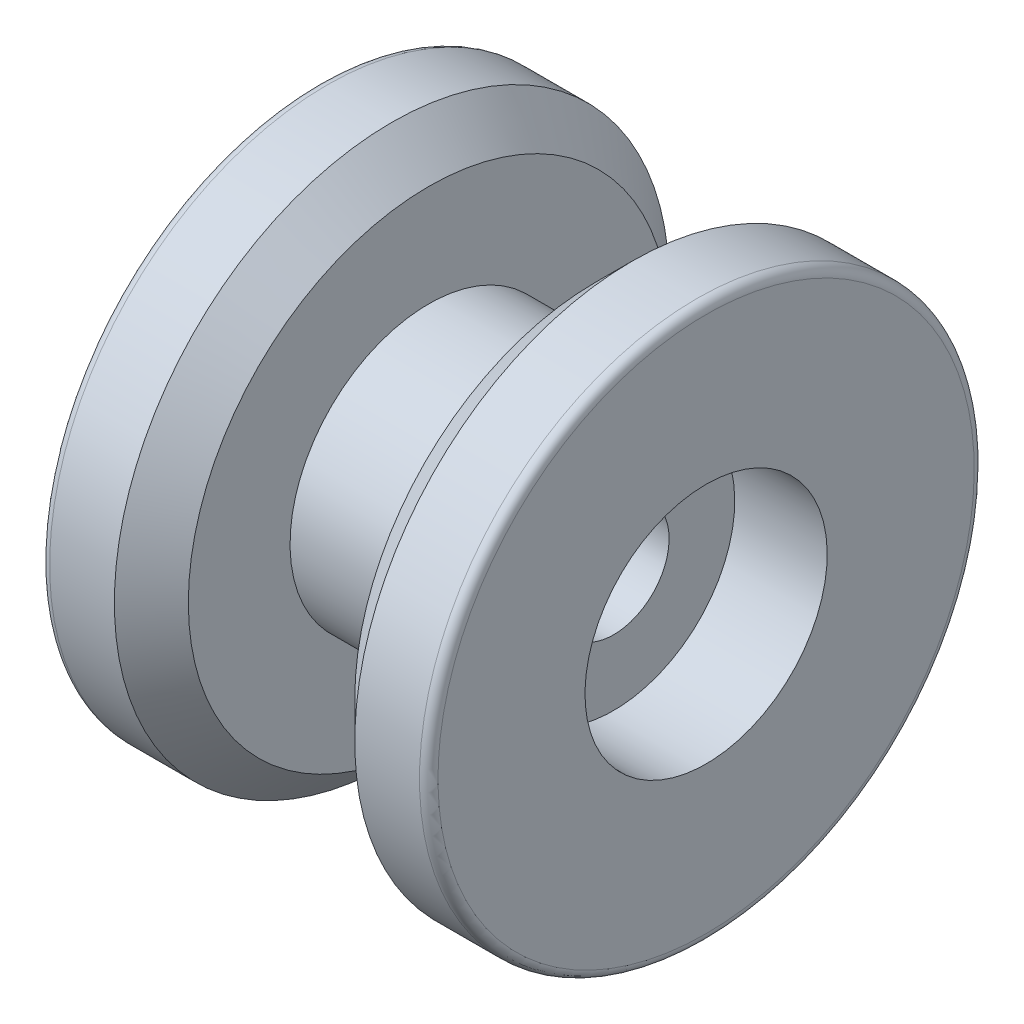
ISO-10303-21;
HEADER;
FILE_DESCRIPTION(('STEP AP214'),'2;1');
FILE_NAME('part.step','',(''),(''),'','','');
FILE_SCHEMA(('AUTOMOTIVE_DESIGN { 1 0 10303 214 1 1 1 1 }'));
ENDSEC;
DATA;
#1=APPLICATION_CONTEXT('core data for automotive mechanical design processes');
#2=APPLICATION_PROTOCOL_DEFINITION('international standard','automotive_design',2000,#1);
#3=PRODUCT_CONTEXT('',#1,'mechanical');
#4=PRODUCT('Part','Part','',(#3));
#5=PRODUCT_RELATED_PRODUCT_CATEGORY('part','',(#4));
#6=PRODUCT_DEFINITION_FORMATION('','',#4);
#7=PRODUCT_DEFINITION_CONTEXT('part definition',#1,'design');
#8=PRODUCT_DEFINITION('design','',#6,#7);
#9=PRODUCT_DEFINITION_SHAPE('','',#8);
#10=(LENGTH_UNIT() NAMED_UNIT(*) SI_UNIT(.MILLI.,.METRE.));
#11=(NAMED_UNIT(*) PLANE_ANGLE_UNIT() SI_UNIT($,.RADIAN.));
#12=(NAMED_UNIT(*) SI_UNIT($,.STERADIAN.) SOLID_ANGLE_UNIT());
#13=UNCERTAINTY_MEASURE_WITH_UNIT(LENGTH_MEASURE(1.E-05),#10,'distance_accuracy_value','');
#14=(GEOMETRIC_REPRESENTATION_CONTEXT(3) GLOBAL_UNCERTAINTY_ASSIGNED_CONTEXT((#13)) GLOBAL_UNIT_ASSIGNED_CONTEXT((#10,
#11,#12)) REPRESENTATION_CONTEXT('',''));
#15=CARTESIAN_POINT('',(0.,0.,0.));
#16=DIRECTION('',(0.,0.,1.));
#17=DIRECTION('',(1.,0.,0.));
#18=AXIS2_PLACEMENT_3D('',#15,#16,#17);
#19=CARTESIAN_POINT('',(-21.,0.,0.));
#20=DIRECTION('',(1.,0.,0.));
#21=DIRECTION('',(0.,1.,0.));
#22=AXIS2_PLACEMENT_3D('',#19,#20,#21);
#23=CYLINDRICAL_SURFACE('',#22,6.);
#24=CARTESIAN_POINT('',(-21.,0.,0.));
#25=DIRECTION('',(-1.,0.,0.));
#26=DIRECTION('',(0.,1.,0.));
#27=AXIS2_PLACEMENT_3D('',#24,#25,#26);
#28=CIRCLE('',#27,6.);
#29=CARTESIAN_POINT('',(-21.,6.,0.));
#30=VERTEX_POINT('',#29);
#31=EDGE_CURVE('E73',#30,#30,#28,.T.);
#32=ORIENTED_EDGE('',*,*,#31,.T.);
#33=EDGE_LOOP('',(#32));
#34=FACE_BOUND('',#33,.T.);
#35=CARTESIAN_POINT('',(11.,0.,0.));
#36=DIRECTION('',(-1.,0.,0.));
#37=DIRECTION('',(0.,1.,0.));
#38=AXIS2_PLACEMENT_3D('',#35,#36,#37);
#39=CIRCLE('',#38,6.);
#40=CARTESIAN_POINT('',(11.,6.,0.));
#41=VERTEX_POINT('',#40);
#42=EDGE_CURVE('E39',#41,#41,#39,.F.);
#43=ORIENTED_EDGE('',*,*,#42,.T.);
#44=EDGE_LOOP('',(#43));
#45=FACE_BOUND('',#44,.T.);
#46=ADVANCED_FACE('F35',(#34,#45),#23,.F.);
#47=CARTESIAN_POINT('',(-21.,30.,0.));
#48=DIRECTION('',(1.,0.,0.));
#49=DIRECTION('',(0.,1.,0.));
#50=AXIS2_PLACEMENT_3D('',#47,#48,#49);
#51=PLANE('',#50);
#52=CARTESIAN_POINT('',(-21.,0.,0.));
#53=DIRECTION('',(-1.,0.,0.));
#54=DIRECTION('',(0.,1.,0.));
#55=AXIS2_PLACEMENT_3D('',#52,#53,#54);
#56=CIRCLE('',#55,29.);
#57=CARTESIAN_POINT('',(-21.,29.,0.));
#58=VERTEX_POINT('',#57);
#59=EDGE_CURVE('E43',#58,#58,#56,.F.);
#60=ORIENTED_EDGE('',*,*,#59,.F.);
#61=EDGE_LOOP('',(#60));
#62=FACE_BOUND('',#61,.T.);
#63=ORIENTED_EDGE('',*,*,#31,.F.);
#64=EDGE_LOOP('',(#63));
#65=FACE_BOUND('',#64,.T.);
#66=ADVANCED_FACE('F99',(#62,#65),#51,.F.);
#67=CARTESIAN_POINT('',(21.,0.,0.));
#68=DIRECTION('',(-1.,0.,0.));
#69=DIRECTION('',(0.,-1.,0.));
#70=AXIS2_PLACEMENT_3D('',#67,#68,#69);
#71=PLANE('',#70);
#72=CARTESIAN_POINT('',(21.,0.,0.));
#73=DIRECTION('',(-1.,0.,0.));
#74=DIRECTION('',(0.,1.,0.));
#75=AXIS2_PLACEMENT_3D('',#72,#73,#74);
#76=CIRCLE('',#75,13.1);
#77=CARTESIAN_POINT('',(21.,13.1,0.));
#78=VERTEX_POINT('',#77);
#79=EDGE_CURVE('E76',#78,#78,#76,.T.);
#80=ORIENTED_EDGE('',*,*,#79,.T.);
#81=EDGE_LOOP('',(#80));
#82=FACE_BOUND('',#81,.T.);
#83=CARTESIAN_POINT('',(21.,0.,0.));
#84=DIRECTION('',(1.,0.,0.));
#85=DIRECTION('',(0.,-1.,0.));
#86=AXIS2_PLACEMENT_3D('',#83,#84,#85);
#87=CIRCLE('',#86,29.);
#88=CARTESIAN_POINT('',(21.,-29.,0.));
#89=VERTEX_POINT('',#88);
#90=EDGE_CURVE('E47',#89,#89,#87,.F.);
#91=ORIENTED_EDGE('',*,*,#90,.F.);
#92=EDGE_LOOP('',(#91));
#93=FACE_BOUND('',#92,.T.);
#94=ADVANCED_FACE('F105',(#82,#93),#71,.F.);
#95=CARTESIAN_POINT('',(-21.,0.,0.));
#96=DIRECTION('',(-1.,0.,0.));
#97=DIRECTION('',(0.,-1.,0.));
#98=AXIS2_PLACEMENT_3D('',#95,#96,#97);
#99=CYLINDRICAL_SURFACE('',#98,30.);
#100=CARTESIAN_POINT('',(20.,0.,0.));
#101=DIRECTION('',(1.,0.,0.));
#102=DIRECTION('',(0.,-1.,0.));
#103=AXIS2_PLACEMENT_3D('',#100,#101,#102);
#104=CIRCLE('',#103,30.);
#105=CARTESIAN_POINT('',(20.,-30.,0.));
#106=VERTEX_POINT('',#105);
#107=EDGE_CURVE('E52',#106,#106,#104,.T.);
#108=ORIENTED_EDGE('',*,*,#107,.F.);
#109=EDGE_LOOP('',(#108));
#110=FACE_BOUND('',#109,.T.);
#111=CARTESIAN_POINT('',(13.,0.,0.));
#112=DIRECTION('',(-1.,0.,0.));
#113=DIRECTION('',(0.,1.,0.));
#114=AXIS2_PLACEMENT_3D('',#111,#112,#113);
#115=CIRCLE('',#114,30.);
#116=CARTESIAN_POINT('',(13.,30.,0.));
#117=VERTEX_POINT('',#116);
#118=EDGE_CURVE('E61',#117,#117,#115,.T.);
#119=ORIENTED_EDGE('',*,*,#118,.F.);
#120=EDGE_LOOP('',(#119));
#121=FACE_BOUND('',#120,.T.);
#122=ADVANCED_FACE('F125',(#110,#121),#99,.T.);
#123=CARTESIAN_POINT('',(9.,30.,0.));
#124=DIRECTION('',(1.,0.,0.));
#125=DIRECTION('',(0.,1.,0.));
#126=AXIS2_PLACEMENT_3D('',#123,#124,#125);
#127=PLANE('',#126);
#128=CARTESIAN_POINT('',(9.,0.,0.));
#129=DIRECTION('',(-1.,0.,0.));
#130=DIRECTION('',(0.,1.,0.));
#131=AXIS2_PLACEMENT_3D('',#128,#129,#130);
#132=CIRCLE('',#131,26.);
#133=CARTESIAN_POINT('',(9.,26.,0.));
#134=VERTEX_POINT('',#133);
#135=EDGE_CURVE('E64',#134,#134,#132,.F.);
#136=ORIENTED_EDGE('',*,*,#135,.F.);
#137=EDGE_LOOP('',(#136));
#138=FACE_BOUND('',#137,.T.);
#139=CARTESIAN_POINT('',(9.,0.,0.));
#140=DIRECTION('',(1.,0.,0.));
#141=DIRECTION('',(0.,-1.,0.));
#142=AXIS2_PLACEMENT_3D('',#139,#140,#141);
#143=CIRCLE('',#142,15.);
#144=CARTESIAN_POINT('',(9.00000000000001,-15.,0.));
#145=VERTEX_POINT('',#144);
#146=EDGE_CURVE('E67',#145,#145,#143,.T.);
#147=ORIENTED_EDGE('',*,*,#146,.T.);
#148=EDGE_LOOP('',(#147));
#149=FACE_BOUND('',#148,.T.);
#150=ADVANCED_FACE('F121',(#138,#149),#127,.F.);
#151=CARTESIAN_POINT('',(-21.,0.,0.));
#152=DIRECTION('',(-1.,0.,0.));
#153=DIRECTION('',(0.,-1.,0.));
#154=AXIS2_PLACEMENT_3D('',#151,#152,#153);
#155=CYLINDRICAL_SURFACE('',#154,15.);
#156=CARTESIAN_POINT('',(-9.,0.,0.));
#157=DIRECTION('',(1.,0.,0.));
#158=DIRECTION('',(0.,-1.,0.));
#159=AXIS2_PLACEMENT_3D('',#156,#157,#158);
#160=CIRCLE('',#159,15.);
#161=CARTESIAN_POINT('',(-8.99999999999999,-15.,0.));
#162=VERTEX_POINT('',#161);
#163=EDGE_CURVE('E70',#162,#162,#160,.T.);
#164=ORIENTED_EDGE('',*,*,#163,.T.);
#165=EDGE_LOOP('',(#164));
#166=FACE_BOUND('',#165,.T.);
#167=ORIENTED_EDGE('',*,*,#146,.F.);
#168=EDGE_LOOP('',(#167));
#169=FACE_BOUND('',#168,.T.);
#170=ADVANCED_FACE('F117',(#166,#169),#155,.T.);
#171=CARTESIAN_POINT('',(-9.,15.,0.));
#172=DIRECTION('',(-1.,0.,0.));
#173=DIRECTION('',(0.,-1.,0.));
#174=AXIS2_PLACEMENT_3D('',#171,#172,#173);
#175=PLANE('',#174);
#176=CARTESIAN_POINT('',(-8.99999999999999,0.,0.));
#177=DIRECTION('',(1.,0.,0.));
#178=DIRECTION('',(0.,-1.,0.));
#179=AXIS2_PLACEMENT_3D('',#176,#177,#178);
#180=CIRCLE('',#179,25.9999999999999);
#181=CARTESIAN_POINT('',(-8.99999999999999,-25.9999999999999,0.));
#182=VERTEX_POINT('',#181);
#183=EDGE_CURVE('E55',#182,#182,#180,.F.);
#184=ORIENTED_EDGE('',*,*,#183,.F.);
#185=EDGE_LOOP('',(#184));
#186=FACE_BOUND('',#185,.T.);
#187=ORIENTED_EDGE('',*,*,#163,.F.);
#188=EDGE_LOOP('',(#187));
#189=FACE_BOUND('',#188,.T.);
#190=ADVANCED_FACE('F113',(#186,#189),#175,.F.);
#191=CARTESIAN_POINT('',(-21.,0.,0.));
#192=DIRECTION('',(-1.,0.,0.));
#193=DIRECTION('',(0.,-1.,0.));
#194=AXIS2_PLACEMENT_3D('',#191,#192,#193);
#195=CYLINDRICAL_SURFACE('',#194,30.);
#196=CARTESIAN_POINT('',(-20.,0.,0.));
#197=DIRECTION('',(-1.,0.,0.));
#198=DIRECTION('',(0.,1.,0.));
#199=AXIS2_PLACEMENT_3D('',#196,#197,#198);
#200=CIRCLE('',#199,30.);
#201=CARTESIAN_POINT('',(-20.,30.,0.));
#202=VERTEX_POINT('',#201);
#203=EDGE_CURVE('E10',#202,#202,#200,.T.);
#204=ORIENTED_EDGE('',*,*,#203,.F.);
#205=EDGE_LOOP('',(#204));
#206=FACE_BOUND('',#205,.T.);
#207=CARTESIAN_POINT('',(-13.,0.,0.));
#208=DIRECTION('',(1.,0.,0.));
#209=DIRECTION('',(0.,-1.,0.));
#210=AXIS2_PLACEMENT_3D('',#207,#208,#209);
#211=CIRCLE('',#210,30.);
#212=CARTESIAN_POINT('',(-13.,-30.,0.));
#213=VERTEX_POINT('',#212);
#214=EDGE_CURVE('E58',#213,#213,#211,.T.);
#215=ORIENTED_EDGE('',*,*,#214,.F.);
#216=EDGE_LOOP('',(#215));
#217=FACE_BOUND('',#216,.T.);
#218=ADVANCED_FACE('F109',(#206,#217),#195,.T.);
#219=CARTESIAN_POINT('',(9.00000000000001,0.,0.));
#220=DIRECTION('',(1.,0.,0.));
#221=DIRECTION('',(0.,1.,0.));
#222=AXIS2_PLACEMENT_3D('',#219,#220,#221);
#223=CONICAL_SURFACE('',#222,26.,0.785398163397447);
#224=ORIENTED_EDGE('',*,*,#118,.T.);
#225=EDGE_LOOP('',(#224));
#226=FACE_BOUND('',#225,.T.);
#227=ORIENTED_EDGE('',*,*,#135,.T.);
#228=EDGE_LOOP('',(#227));
#229=FACE_BOUND('',#228,.T.);
#230=ADVANCED_FACE('F112',(#226,#229),#223,.T.);
#231=CARTESIAN_POINT('',(-13.,0.,0.));
#232=DIRECTION('',(-1.,0.,0.));
#233=DIRECTION('',(0.,-1.,0.));
#234=AXIS2_PLACEMENT_3D('',#231,#232,#233);
#235=CONICAL_SURFACE('',#234,30.,0.785398163397451);
#236=ORIENTED_EDGE('',*,*,#183,.T.);
#237=EDGE_LOOP('',(#236));
#238=FACE_BOUND('',#237,.T.);
#239=ORIENTED_EDGE('',*,*,#214,.T.);
#240=EDGE_LOOP('',(#239));
#241=FACE_BOUND('',#240,.T.);
#242=ADVANCED_FACE('F135',(#238,#241),#235,.T.);
#243=CARTESIAN_POINT('',(20.,0.,0.));
#244=DIRECTION('',(-1.,0.,0.));
#245=DIRECTION('',(0.,-1.,0.));
#246=AXIS2_PLACEMENT_3D('',#243,#244,#245);
#247=TOROIDAL_SURFACE('',#246,29.,1.);
#248=ORIENTED_EDGE('',*,*,#90,.T.);
#249=EDGE_LOOP('',(#248));
#250=FACE_BOUND('',#249,.T.);
#251=ORIENTED_EDGE('',*,*,#107,.T.);
#252=EDGE_LOOP('',(#251));
#253=FACE_BOUND('',#252,.T.);
#254=ADVANCED_FACE('F97',(#250,#253),#247,.T.);
#255=CARTESIAN_POINT('',(-20.,0.,0.));
#256=DIRECTION('',(1.,0.,0.));
#257=DIRECTION('',(0.,1.,0.));
#258=AXIS2_PLACEMENT_3D('',#255,#256,#257);
#259=TOROIDAL_SURFACE('',#258,29.,1.);
#260=ORIENTED_EDGE('',*,*,#203,.T.);
#261=EDGE_LOOP('',(#260));
#262=FACE_BOUND('',#261,.T.);
#263=ORIENTED_EDGE('',*,*,#59,.T.);
#264=EDGE_LOOP('',(#263));
#265=FACE_BOUND('',#264,.T.);
#266=ADVANCED_FACE('F37',(#262,#265),#259,.T.);
#267=CARTESIAN_POINT('',(11.,0.,0.));
#268=DIRECTION('',(1.,0.,0.));
#269=DIRECTION('',(0.,1.,0.));
#270=AXIS2_PLACEMENT_3D('',#267,#268,#269);
#271=PLANE('',#270);
#272=CARTESIAN_POINT('',(11.,0.,0.));
#273=DIRECTION('',(-1.,0.,0.));
#274=DIRECTION('',(0.,1.,0.));
#275=AXIS2_PLACEMENT_3D('',#272,#273,#274);
#276=CIRCLE('',#275,13.1);
#277=CARTESIAN_POINT('',(11.,13.1,0.));
#278=VERTEX_POINT('',#277);
#279=EDGE_CURVE('E79',#278,#278,#276,.T.);
#280=ORIENTED_EDGE('',*,*,#279,.F.);
#281=EDGE_LOOP('',(#280));
#282=FACE_BOUND('',#281,.T.);
#283=ORIENTED_EDGE('',*,*,#42,.F.);
#284=EDGE_LOOP('',(#283));
#285=FACE_BOUND('',#284,.T.);
#286=ADVANCED_FACE('F87',(#282,#285),#271,.T.);
#287=CARTESIAN_POINT('',(11.,0.,0.));
#288=DIRECTION('',(1.,0.,0.));
#289=DIRECTION('',(0.,1.,0.));
#290=AXIS2_PLACEMENT_3D('',#287,#288,#289);
#291=CYLINDRICAL_SURFACE('',#290,13.1);
#292=ORIENTED_EDGE('',*,*,#279,.T.);
#293=EDGE_LOOP('',(#292));
#294=FACE_BOUND('',#293,.T.);
#295=ORIENTED_EDGE('',*,*,#79,.F.);
#296=EDGE_LOOP('',(#295));
#297=FACE_BOUND('',#296,.T.);
#298=ADVANCED_FACE('F89',(#294,#297),#291,.F.);
#299=CLOSED_SHELL('',(#46,#66,#94,#122,#150,#170,#190,#218,#230,#242,#254,#266,#286,#298));
#300=MANIFOLD_SOLID_BREP('B2',#299);
#301=ADVANCED_BREP_SHAPE_REPRESENTATION('',(#18,#300),#14);
#302=SHAPE_DEFINITION_REPRESENTATION(#9,#301);
ENDSEC;
END-ISO-10303-21;
